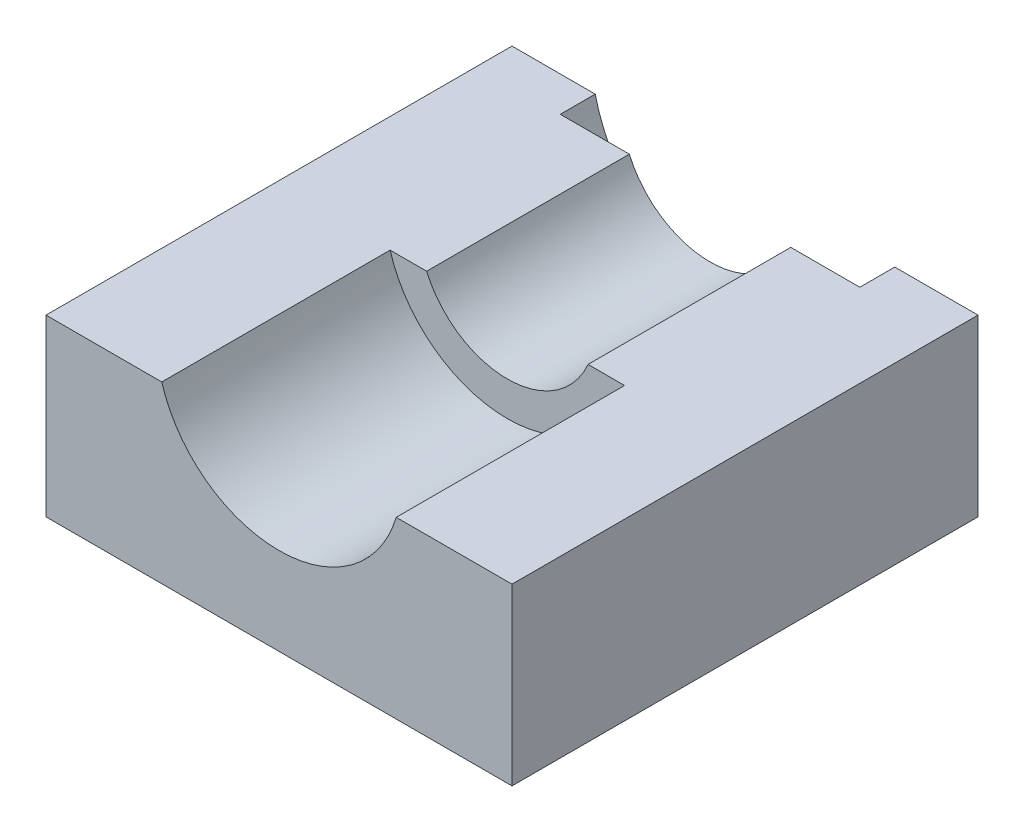
ISO-10303-21;
HEADER;
FILE_DESCRIPTION(('STEP AP214'),'2;1');
FILE_NAME('part.step','',(''),(''),'','','');
FILE_SCHEMA(('AUTOMOTIVE_DESIGN { 1 0 10303 214 1 1 1 1 }'));
ENDSEC;
DATA;
#1=APPLICATION_CONTEXT('core data for automotive mechanical design processes');
#2=APPLICATION_PROTOCOL_DEFINITION('international standard','automotive_design',2000,#1);
#3=PRODUCT_CONTEXT('',#1,'mechanical');
#4=PRODUCT('Part','Part','',(#3));
#5=PRODUCT_RELATED_PRODUCT_CATEGORY('part','',(#4));
#6=PRODUCT_DEFINITION_FORMATION('','',#4);
#7=PRODUCT_DEFINITION_CONTEXT('part definition',#1,'design');
#8=PRODUCT_DEFINITION('design','',#6,#7);
#9=PRODUCT_DEFINITION_SHAPE('','',#8);
#10=(LENGTH_UNIT() NAMED_UNIT(*) SI_UNIT(.MILLI.,.METRE.));
#11=(NAMED_UNIT(*) PLANE_ANGLE_UNIT() SI_UNIT($,.RADIAN.));
#12=(NAMED_UNIT(*) SI_UNIT($,.STERADIAN.) SOLID_ANGLE_UNIT());
#13=UNCERTAINTY_MEASURE_WITH_UNIT(LENGTH_MEASURE(1.E-05),#10,'distance_accuracy_value','');
#14=(GEOMETRIC_REPRESENTATION_CONTEXT(3) GLOBAL_UNCERTAINTY_ASSIGNED_CONTEXT((#13)) GLOBAL_UNIT_ASSIGNED_CONTEXT((#10,
#11,#12)) REPRESENTATION_CONTEXT('',''));
#15=CARTESIAN_POINT('',(0.,0.,0.));
#16=DIRECTION('',(0.,0.,1.));
#17=DIRECTION('',(1.,0.,0.));
#18=AXIS2_PLACEMENT_3D('',#15,#16,#17);
#19=CARTESIAN_POINT('',(-100.,37.5,200.));
#20=DIRECTION('',(0.,-1.,0.));
#21=DIRECTION('',(0.,0.,-1.));
#22=AXIS2_PLACEMENT_3D('',#19,#20,#21);
#23=PLANE('',#22);
#24=DIRECTION('',(-1.,0.,0.));
#25=VECTOR('',#24,1.);
#26=CARTESIAN_POINT('',(-100.,37.5,0.));
#27=LINE('',#26,#25);
#28=CARTESIAN_POINT('',(100.,37.5,0.));
#29=VERTEX_POINT('',#28);
#30=CARTESIAN_POINT('',(64.2723359938004,37.5,0.));
#31=VERTEX_POINT('',#30);
#32=EDGE_CURVE('E166',#29,#31,#27,.T.);
#33=ORIENTED_EDGE('',*,*,#32,.T.);
#34=DIRECTION('',(0.,0.,1.));
#35=VECTOR('',#34,1.);
#36=CARTESIAN_POINT('',(64.2723359938004,37.5,-185.));
#37=LINE('',#36,#35);
#38=CARTESIAN_POINT('',(64.2723359938004,37.5,15.0000000000002));
#39=VERTEX_POINT('',#38);
#40=EDGE_CURVE('E120',#31,#39,#37,.T.);
#41=ORIENTED_EDGE('',*,*,#40,.T.);
#42=DIRECTION('',(-1.,0.,0.));
#43=VECTOR('',#42,1.);
#44=CARTESIAN_POINT('',(-100.,37.5,15.0000000000002));
#45=LINE('',#44,#43);
#46=CARTESIAN_POINT('',(34.6415337492361,37.5,15.0000000000002));
#47=VERTEX_POINT('',#46);
#48=EDGE_CURVE('E121',#39,#47,#45,.T.);
#49=ORIENTED_EDGE('',*,*,#48,.T.);
#50=DIRECTION('',(0.,0.,1.));
#51=VECTOR('',#50,1.);
#52=CARTESIAN_POINT('',(34.6415337492361,37.5,-91.773123959168));
#53=LINE('',#52,#51);
#54=CARTESIAN_POINT('',(34.6415337492361,37.5,102.));
#55=VERTEX_POINT('',#54);
#56=EDGE_CURVE('E138',#47,#55,#53,.T.);
#57=ORIENTED_EDGE('',*,*,#56,.T.);
#58=DIRECTION('',(-1.,0.,0.));
#59=VECTOR('',#58,1.);
#60=CARTESIAN_POINT('',(-100.,37.5,102.));
#61=LINE('',#60,#59);
#62=CARTESIAN_POINT('',(50.3110535460367,37.5,102.));
#63=VERTEX_POINT('',#62);
#64=EDGE_CURVE('E41',#63,#55,#61,.T.);
#65=ORIENTED_EDGE('',*,*,#64,.F.);
#66=DIRECTION('',(0.,0.,1.));
#67=VECTOR('',#66,1.);
#68=CARTESIAN_POINT('',(50.3110535460367,37.5,-46.4924240491761));
#69=LINE('',#68,#67);
#70=CARTESIAN_POINT('',(50.3110535460367,37.5,200.));
#71=VERTEX_POINT('',#70);
#72=EDGE_CURVE('E146',#63,#71,#69,.T.);
#73=ORIENTED_EDGE('',*,*,#72,.T.);
#74=DIRECTION('',(-1.,0.,0.));
#75=VECTOR('',#74,1.);
#76=CARTESIAN_POINT('',(-100.,37.5,200.));
#77=LINE('',#76,#75);
#78=CARTESIAN_POINT('',(100.,37.5,200.));
#79=VERTEX_POINT('',#78);
#80=EDGE_CURVE('E155',#79,#71,#77,.T.);
#81=ORIENTED_EDGE('',*,*,#80,.F.);
#82=DIRECTION('',(0.,0.,-1.));
#83=VECTOR('',#82,1.);
#84=CARTESIAN_POINT('',(100.,37.5,200.));
#85=LINE('',#84,#83);
#86=EDGE_CURVE('E180',#79,#29,#85,.T.);
#87=ORIENTED_EDGE('',*,*,#86,.T.);
#88=EDGE_LOOP('',(#33,#41,#49,#57,#65,#73,#81,#87));
#89=FACE_BOUND('',#88,.T.);
#90=ADVANCED_FACE('F33',(#89),#23,.F.);
#91=CARTESIAN_POINT('',(100.,-37.5,200.));
#92=DIRECTION('',(-1.,0.,0.));
#93=DIRECTION('',(0.,0.,1.));
#94=AXIS2_PLACEMENT_3D('',#91,#92,#93);
#95=PLANE('',#94);
#96=DIRECTION('',(0.,1.,0.));
#97=VECTOR('',#96,1.);
#98=CARTESIAN_POINT('',(100.,-37.5,0.));
#99=LINE('',#98,#97);
#100=CARTESIAN_POINT('',(100.,-37.5,0.));
#101=VERTEX_POINT('',#100);
#102=EDGE_CURVE('E149',#101,#29,#99,.T.);
#103=ORIENTED_EDGE('',*,*,#102,.T.);
#104=ORIENTED_EDGE('',*,*,#86,.F.);
#105=DIRECTION('',(0.,1.,0.));
#106=VECTOR('',#105,1.);
#107=CARTESIAN_POINT('',(100.,-37.5,200.));
#108=LINE('',#107,#106);
#109=CARTESIAN_POINT('',(100.,-37.5,200.));
#110=VERTEX_POINT('',#109);
#111=EDGE_CURVE('E150',#110,#79,#108,.T.);
#112=ORIENTED_EDGE('',*,*,#111,.F.);
#113=DIRECTION('',(0.,0.,-1.));
#114=VECTOR('',#113,1.);
#115=CARTESIAN_POINT('',(100.,-37.5,200.));
#116=LINE('',#115,#114);
#117=EDGE_CURVE('E162',#110,#101,#116,.T.);
#118=ORIENTED_EDGE('',*,*,#117,.T.);
#119=EDGE_LOOP('',(#103,#104,#112,#118));
#120=FACE_BOUND('',#119,.T.);
#121=ADVANCED_FACE('F35',(#120),#95,.F.);
#122=CARTESIAN_POINT('',(-34.6428899865443,37.5,15.0000000000002));
#123=VERTEX_POINT('',#122);
#124=CARTESIAN_POINT('',(-64.2736922311086,37.5,15.0000000000002));
#125=VERTEX_POINT('',#124);
#126=EDGE_CURVE('E125',#123,#125,#45,.T.);
#127=ORIENTED_EDGE('',*,*,#126,.T.);
#128=DIRECTION('',(0.,0.,1.));
#129=VECTOR('',#128,1.);
#130=CARTESIAN_POINT('',(-64.2736922311086,37.5,-185.));
#131=LINE('',#130,#129);
#132=CARTESIAN_POINT('',(-64.2736922311086,37.5,0.));
#133=VERTEX_POINT('',#132);
#134=EDGE_CURVE('E111',#125,#133,#131,.F.);
#135=ORIENTED_EDGE('',*,*,#134,.T.);
#136=CARTESIAN_POINT('',(-100.,37.5,0.));
#137=VERTEX_POINT('',#136);
#138=EDGE_CURVE('E165',#133,#137,#27,.T.);
#139=ORIENTED_EDGE('',*,*,#138,.T.);
#140=DIRECTION('',(0.,0.,-1.));
#141=VECTOR('',#140,1.);
#142=CARTESIAN_POINT('',(-100.,37.5,200.));
#143=LINE('',#142,#141);
#144=CARTESIAN_POINT('',(-100.,37.5,200.));
#145=VERTEX_POINT('',#144);
#146=EDGE_CURVE('E177',#145,#137,#143,.T.);
#147=ORIENTED_EDGE('',*,*,#146,.F.);
#148=CARTESIAN_POINT('',(-50.312409783345,37.5,200.));
#149=VERTEX_POINT('',#148);
#150=EDGE_CURVE('E153',#149,#145,#77,.T.);
#151=ORIENTED_EDGE('',*,*,#150,.F.);
#152=DIRECTION('',(0.,0.,1.));
#153=VECTOR('',#152,1.);
#154=CARTESIAN_POINT('',(-50.312409783345,37.5,-46.4924240491761));
#155=LINE('',#154,#153);
#156=CARTESIAN_POINT('',(-50.312409783345,37.5,102.));
#157=VERTEX_POINT('',#156);
#158=EDGE_CURVE('E56',#149,#157,#155,.F.);
#159=ORIENTED_EDGE('',*,*,#158,.T.);
#160=CARTESIAN_POINT('',(-34.6428899865443,37.5,102.));
#161=VERTEX_POINT('',#160);
#162=EDGE_CURVE('E182',#161,#157,#61,.T.);
#163=ORIENTED_EDGE('',*,*,#162,.F.);
#164=DIRECTION('',(0.,0.,1.));
#165=VECTOR('',#164,1.);
#166=CARTESIAN_POINT('',(-34.6428899865443,37.5,-91.773123959168));
#167=LINE('',#166,#165);
#168=EDGE_CURVE('E48',#161,#123,#167,.F.);
#169=ORIENTED_EDGE('',*,*,#168,.T.);
#170=EDGE_LOOP('',(#127,#135,#139,#147,#151,#159,#163,#169));
#171=FACE_BOUND('',#170,.T.);
#172=ADVANCED_FACE('F128',(#171),#23,.F.);
#173=CARTESIAN_POINT('',(-100.,-37.5,200.));
#174=DIRECTION('',(1.,0.,0.));
#175=DIRECTION('',(0.,0.,-1.));
#176=AXIS2_PLACEMENT_3D('',#173,#174,#175);
#177=PLANE('',#176);
#178=DIRECTION('',(0.,-1.,0.));
#179=VECTOR('',#178,1.);
#180=CARTESIAN_POINT('',(-100.,-37.5,0.));
#181=LINE('',#180,#179);
#182=CARTESIAN_POINT('',(-100.,-37.5,0.));
#183=VERTEX_POINT('',#182);
#184=EDGE_CURVE('E169',#137,#183,#181,.T.);
#185=ORIENTED_EDGE('',*,*,#184,.T.);
#186=DIRECTION('',(0.,0.,-1.));
#187=VECTOR('',#186,1.);
#188=CARTESIAN_POINT('',(-100.,-37.5,200.));
#189=LINE('',#188,#187);
#190=CARTESIAN_POINT('',(-100.,-37.5,200.));
#191=VERTEX_POINT('',#190);
#192=EDGE_CURVE('E174',#191,#183,#189,.T.);
#193=ORIENTED_EDGE('',*,*,#192,.F.);
#194=DIRECTION('',(0.,-1.,0.));
#195=VECTOR('',#194,1.);
#196=CARTESIAN_POINT('',(-100.,-37.5,200.));
#197=LINE('',#196,#195);
#198=EDGE_CURVE('E158',#145,#191,#197,.T.);
#199=ORIENTED_EDGE('',*,*,#198,.F.);
#200=ORIENTED_EDGE('',*,*,#146,.T.);
#201=EDGE_LOOP('',(#185,#193,#199,#200));
#202=FACE_BOUND('',#201,.T.);
#203=ADVANCED_FACE('F214',(#202),#177,.F.);
#204=CARTESIAN_POINT('',(-100.,-37.5,200.));
#205=DIRECTION('',(0.,1.,0.));
#206=DIRECTION('',(0.,0.,1.));
#207=AXIS2_PLACEMENT_3D('',#204,#205,#206);
#208=PLANE('',#207);
#209=DIRECTION('',(1.,0.,0.));
#210=VECTOR('',#209,1.);
#211=CARTESIAN_POINT('',(-100.,-37.5,0.));
#212=LINE('',#211,#210);
#213=EDGE_CURVE('E154',#183,#101,#212,.T.);
#214=ORIENTED_EDGE('',*,*,#213,.T.);
#215=ORIENTED_EDGE('',*,*,#117,.F.);
#216=DIRECTION('',(1.,0.,0.));
#217=VECTOR('',#216,1.);
#218=CARTESIAN_POINT('',(-100.,-37.5,200.));
#219=LINE('',#218,#217);
#220=EDGE_CURVE('E160',#191,#110,#219,.T.);
#221=ORIENTED_EDGE('',*,*,#220,.F.);
#222=ORIENTED_EDGE('',*,*,#192,.T.);
#223=EDGE_LOOP('',(#214,#215,#221,#222));
#224=FACE_BOUND('',#223,.T.);
#225=ADVANCED_FACE('F218',(#224),#208,.F.);
#226=CARTESIAN_POINT('',(0.,0.,200.));
#227=DIRECTION('',(0.,0.,-1.));
#228=DIRECTION('',(-1.,0.,0.));
#229=AXIS2_PLACEMENT_3D('',#226,#227,#228);
#230=PLANE('',#229);
#231=ORIENTED_EDGE('',*,*,#80,.T.);
#232=CARTESIAN_POINT('',(-0.000678118654118265,52.499321881345,200.));
#233=DIRECTION('',(0.,0.,1.));
#234=DIRECTION('',(1.,0.,0.));
#235=AXIS2_PLACEMENT_3D('',#232,#233,#234);
#236=CIRCLE('',#235,52.5000000000005);
#237=EDGE_CURVE('E141',#149,#71,#236,.T.);
#238=ORIENTED_EDGE('',*,*,#237,.F.);
#239=ORIENTED_EDGE('',*,*,#150,.T.);
#240=ORIENTED_EDGE('',*,*,#198,.T.);
#241=ORIENTED_EDGE('',*,*,#220,.T.);
#242=ORIENTED_EDGE('',*,*,#111,.T.);
#243=EDGE_LOOP('',(#231,#238,#239,#240,#241,#242));
#244=FACE_BOUND('',#243,.T.);
#245=ADVANCED_FACE('F193',(#244),#230,.F.);
#246=CARTESIAN_POINT('',(0.,0.,0.));
#247=DIRECTION('',(0.,0.,-1.));
#248=DIRECTION('',(-1.,0.,0.));
#249=AXIS2_PLACEMENT_3D('',#246,#247,#248);
#250=PLANE('',#249);
#251=CARTESIAN_POINT('',(-0.000678118654118265,52.499321881345,0.));
#252=DIRECTION('',(0.,0.,-1.));
#253=DIRECTION('',(-1.,0.,0.));
#254=AXIS2_PLACEMENT_3D('',#251,#252,#253);
#255=CIRCLE('',#254,65.9999999999998);
#256=EDGE_CURVE('E11',#31,#133,#255,.T.);
#257=ORIENTED_EDGE('',*,*,#256,.F.);
#258=ORIENTED_EDGE('',*,*,#32,.F.);
#259=ORIENTED_EDGE('',*,*,#102,.F.);
#260=ORIENTED_EDGE('',*,*,#213,.F.);
#261=ORIENTED_EDGE('',*,*,#184,.F.);
#262=ORIENTED_EDGE('',*,*,#138,.F.);
#263=EDGE_LOOP('',(#257,#258,#259,#260,#261,#262));
#264=FACE_BOUND('',#263,.T.);
#265=ADVANCED_FACE('F226',(#264),#250,.T.);
#266=CARTESIAN_POINT('',(36.9590135864258,60.1833110188608,102.));
#267=DIRECTION('',(0.,0.,1.));
#268=DIRECTION('',(0.203549381126245,-0.979064680929265,0.));
#269=AXIS2_PLACEMENT_3D('',#266,#267,#268);
#270=PLANE('',#269);
#271=CARTESIAN_POINT('',(-0.000678118654118265,52.499321881345,102.));
#272=DIRECTION('',(0.,0.,1.));
#273=DIRECTION('',(1.,0.,0.));
#274=AXIS2_PLACEMENT_3D('',#271,#272,#273);
#275=CIRCLE('',#274,37.7499999999998);
#276=EDGE_CURVE('E133',#161,#55,#275,.T.);
#277=ORIENTED_EDGE('',*,*,#276,.F.);
#278=ORIENTED_EDGE('',*,*,#162,.T.);
#279=CARTESIAN_POINT('',(-0.000678118654118265,52.499321881345,102.));
#280=DIRECTION('',(0.,0.,1.));
#281=DIRECTION('',(1.,0.,0.));
#282=AXIS2_PLACEMENT_3D('',#279,#280,#281);
#283=CIRCLE('',#282,52.5000000000005);
#284=EDGE_CURVE('E143',#63,#157,#283,.F.);
#285=ORIENTED_EDGE('',*,*,#284,.F.);
#286=ORIENTED_EDGE('',*,*,#64,.T.);
#287=EDGE_LOOP('',(#277,#278,#285,#286));
#288=FACE_BOUND('',#287,.T.);
#289=ADVANCED_FACE('F187',(#288),#270,.T.);
#290=CARTESIAN_POINT('',(-0.000678118654118265,52.499321881345,-46.4924240491761));
#291=DIRECTION('',(0.,0.,1.));
#292=DIRECTION('',(1.,0.,0.));
#293=AXIS2_PLACEMENT_3D('',#290,#291,#292);
#294=CYLINDRICAL_SURFACE('',#293,52.5000000000005);
#295=ORIENTED_EDGE('',*,*,#284,.T.);
#296=ORIENTED_EDGE('',*,*,#158,.F.);
#297=ORIENTED_EDGE('',*,*,#237,.T.);
#298=ORIENTED_EDGE('',*,*,#72,.F.);
#299=EDGE_LOOP('',(#295,#296,#297,#298));
#300=FACE_BOUND('',#299,.T.);
#301=ADVANCED_FACE('F188',(#300),#294,.F.);
#302=CARTESIAN_POINT('',(-0.000678118654118265,52.499321881345,-91.773123959168));
#303=DIRECTION('',(0.,0.,1.));
#304=DIRECTION('',(1.,0.,0.));
#305=AXIS2_PLACEMENT_3D('',#302,#303,#304);
#306=CYLINDRICAL_SURFACE('',#305,37.7499999999998);
#307=CARTESIAN_POINT('',(-0.000678118654118265,52.499321881345,15.0000000000002));
#308=DIRECTION('',(0.,0.,-1.));
#309=DIRECTION('',(-1.,0.,0.));
#310=AXIS2_PLACEMENT_3D('',#307,#308,#309);
#311=CIRCLE('',#310,37.7499999999998);
#312=EDGE_CURVE('E135',#123,#47,#311,.F.);
#313=ORIENTED_EDGE('',*,*,#312,.F.);
#314=ORIENTED_EDGE('',*,*,#168,.F.);
#315=ORIENTED_EDGE('',*,*,#276,.T.);
#316=ORIENTED_EDGE('',*,*,#56,.F.);
#317=EDGE_LOOP('',(#313,#314,#315,#316));
#318=FACE_BOUND('',#317,.T.);
#319=ADVANCED_FACE('F197',(#318),#306,.F.);
#320=CARTESIAN_POINT('',(-0.000678118654118265,52.499321881345,-185.));
#321=DIRECTION('',(0.,0.,1.));
#322=DIRECTION('',(1.,0.,0.));
#323=AXIS2_PLACEMENT_3D('',#320,#321,#322);
#324=CYLINDRICAL_SURFACE('',#323,65.9999999999998);
#325=ORIENTED_EDGE('',*,*,#256,.T.);
#326=ORIENTED_EDGE('',*,*,#134,.F.);
#327=CARTESIAN_POINT('',(-0.000678118654118265,52.499321881345,15.0000000000002));
#328=DIRECTION('',(0.,0.,1.));
#329=DIRECTION('',(1.,0.,0.));
#330=AXIS2_PLACEMENT_3D('',#327,#328,#329);
#331=CIRCLE('',#330,65.9999999999998);
#332=EDGE_CURVE('E114',#125,#39,#331,.T.);
#333=ORIENTED_EDGE('',*,*,#332,.T.);
#334=ORIENTED_EDGE('',*,*,#40,.F.);
#335=EDGE_LOOP('',(#325,#326,#333,#334));
#336=FACE_BOUND('',#335,.T.);
#337=ADVANCED_FACE('F113',(#336),#324,.F.);
#338=CARTESIAN_POINT('',(-0.000678118654118265,52.499321881345,15.0000000000002));
#339=DIRECTION('',(0.,0.,1.));
#340=DIRECTION('',(1.,0.,0.));
#341=AXIS2_PLACEMENT_3D('',#338,#339,#340);
#342=PLANE('',#341);
#343=ORIENTED_EDGE('',*,*,#332,.F.);
#344=ORIENTED_EDGE('',*,*,#126,.F.);
#345=ORIENTED_EDGE('',*,*,#312,.T.);
#346=ORIENTED_EDGE('',*,*,#48,.F.);
#347=EDGE_LOOP('',(#343,#344,#345,#346));
#348=FACE_BOUND('',#347,.T.);
#349=ADVANCED_FACE('F124',(#348),#342,.F.);
#350=CLOSED_SHELL('',(#90,#121,#172,#203,#225,#245,#265,#289,#301,#319,#337,#349));
#351=MANIFOLD_SOLID_BREP('B2',#350);
#352=ADVANCED_BREP_SHAPE_REPRESENTATION('',(#18,#351),#14);
#353=SHAPE_DEFINITION_REPRESENTATION(#9,#352);
ENDSEC;
END-ISO-10303-21;
